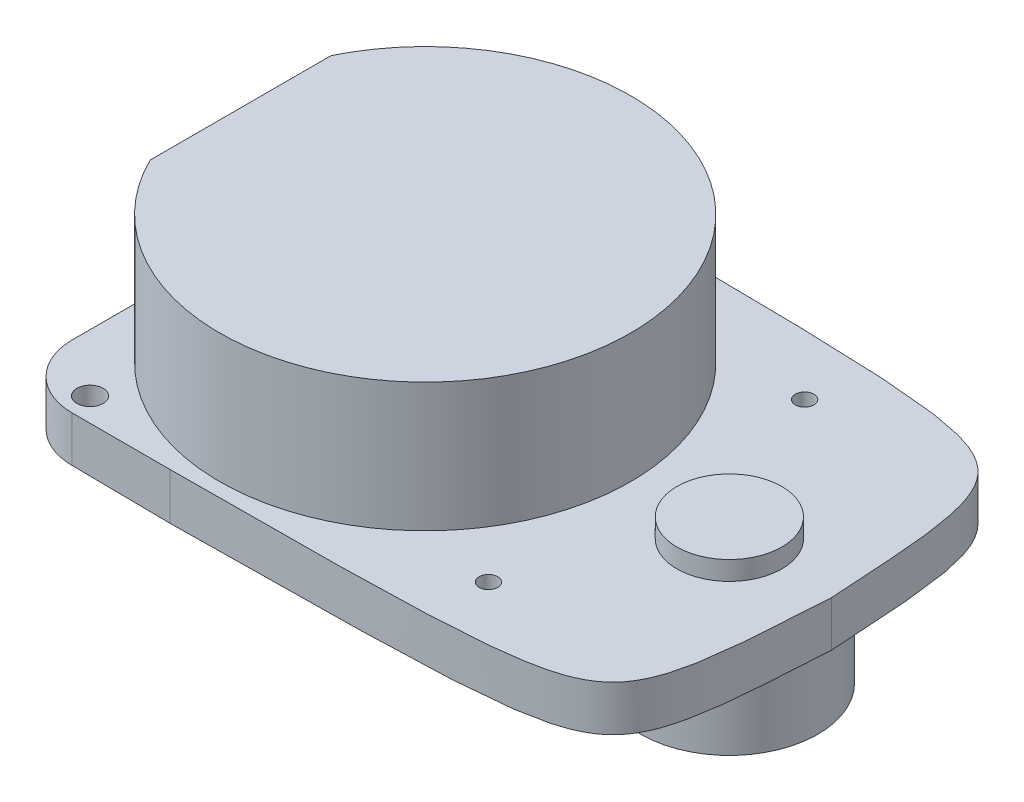
ISO-10303-21;
HEADER;
FILE_DESCRIPTION(('STEP AP214'),'2;1');
FILE_NAME('part.step','',(''),(''),'','','');
FILE_SCHEMA(('AUTOMOTIVE_DESIGN { 1 0 10303 214 1 1 1 1 }'));
ENDSEC;
DATA;
#1=APPLICATION_CONTEXT('core data for automotive mechanical design processes');
#2=APPLICATION_PROTOCOL_DEFINITION('international standard','automotive_design',2000,#1);
#3=PRODUCT_CONTEXT('',#1,'mechanical');
#4=PRODUCT('Part','Part','',(#3));
#5=PRODUCT_RELATED_PRODUCT_CATEGORY('part','',(#4));
#6=PRODUCT_DEFINITION_FORMATION('','',#4);
#7=PRODUCT_DEFINITION_CONTEXT('part definition',#1,'design');
#8=PRODUCT_DEFINITION('design','',#6,#7);
#9=PRODUCT_DEFINITION_SHAPE('','',#8);
#10=(LENGTH_UNIT() NAMED_UNIT(*) SI_UNIT(.MILLI.,.METRE.));
#11=(NAMED_UNIT(*) PLANE_ANGLE_UNIT() SI_UNIT($,.RADIAN.));
#12=(NAMED_UNIT(*) SI_UNIT($,.STERADIAN.) SOLID_ANGLE_UNIT());
#13=UNCERTAINTY_MEASURE_WITH_UNIT(LENGTH_MEASURE(1.E-05),#10,'distance_accuracy_value','');
#14=(GEOMETRIC_REPRESENTATION_CONTEXT(3) GLOBAL_UNCERTAINTY_ASSIGNED_CONTEXT((#13)) GLOBAL_UNIT_ASSIGNED_CONTEXT((#10,
#11,#12)) REPRESENTATION_CONTEXT('',''));
#15=CARTESIAN_POINT('',(0.,0.,0.));
#16=DIRECTION('',(0.,0.,1.));
#17=DIRECTION('',(1.,0.,0.));
#18=AXIS2_PLACEMENT_3D('',#15,#16,#17);
#19=CARTESIAN_POINT('',(-48.1,40.16,0.));
#20=DIRECTION('',(0.,-1.,0.));
#21=DIRECTION('',(0.,0.,-1.));
#22=AXIS2_PLACEMENT_3D('',#19,#20,#21);
#23=CYLINDRICAL_SURFACE('',#22,32.5);
#24=DIRECTION('',(0.,1.,0.));
#25=VECTOR('',#24,1.);
#26=CARTESIAN_POINT('',(-77.2815278238156,-9.00565904567411,-14.3069365647534));
#27=LINE('',#26,#25);
#28=CARTESIAN_POINT('',(-77.2815278238156,19.8,-14.3069365647534));
#29=VERTEX_POINT('',#28);
#30=CARTESIAN_POINT('',(-77.2815278238156,40.16,-14.3069365647534));
#31=VERTEX_POINT('',#30);
#32=EDGE_CURVE('E127',#29,#31,#27,.T.);
#33=ORIENTED_EDGE('',*,*,#32,.T.);
#34=CARTESIAN_POINT('',(-48.1,40.16,0.));
#35=DIRECTION('',(0.,1.,0.));
#36=DIRECTION('',(0.,0.,1.));
#37=AXIS2_PLACEMENT_3D('',#34,#35,#36);
#38=CIRCLE('',#37,32.5);
#39=CARTESIAN_POINT('',(-77.2815278238156,40.16,14.3069365647534));
#40=VERTEX_POINT('',#39);
#41=EDGE_CURVE('E137',#40,#31,#38,.T.);
#42=ORIENTED_EDGE('',*,*,#41,.F.);
#43=DIRECTION('',(0.,1.,0.));
#44=VECTOR('',#43,1.);
#45=CARTESIAN_POINT('',(-77.2815278238156,-9.00565904567411,14.3069365647534));
#46=LINE('',#45,#44);
#47=CARTESIAN_POINT('',(-77.2815278238156,19.8,14.3069365647534));
#48=VERTEX_POINT('',#47);
#49=EDGE_CURVE('E130',#48,#40,#46,.T.);
#50=ORIENTED_EDGE('',*,*,#49,.F.);
#51=CARTESIAN_POINT('',(-48.1,19.8,0.));
#52=DIRECTION('',(0.,1.,0.));
#53=DIRECTION('',(0.,0.,1.));
#54=AXIS2_PLACEMENT_3D('',#51,#52,#53);
#55=CIRCLE('',#54,32.5);
#56=EDGE_CURVE('E139',#48,#29,#55,.T.);
#57=ORIENTED_EDGE('',*,*,#56,.T.);
#58=EDGE_LOOP('',(#33,#42,#50,#57));
#59=FACE_BOUND('',#58,.T.);
#60=ADVANCED_FACE('F42',(#59),#23,.T.);
#61=CARTESIAN_POINT('',(-48.1,40.16,0.));
#62=DIRECTION('',(0.,1.,0.));
#63=DIRECTION('',(0.,0.,1.));
#64=AXIS2_PLACEMENT_3D('',#61,#62,#63);
#65=PLANE('',#64);
#66=ORIENTED_EDGE('',*,*,#41,.T.);
#67=DIRECTION('',(0.,0.,1.));
#68=VECTOR('',#67,1.);
#69=CARTESIAN_POINT('',(-77.2815278238156,40.16,0.));
#70=LINE('',#69,#68);
#71=EDGE_CURVE('E124',#31,#40,#70,.T.);
#72=ORIENTED_EDGE('',*,*,#71,.T.);
#73=EDGE_LOOP('',(#66,#72));
#74=FACE_BOUND('',#73,.T.);
#75=ADVANCED_FACE('F141',(#74),#65,.T.);
#76=CARTESIAN_POINT('',(0.,12.6,0.));
#77=DIRECTION('',(0.,-1.,0.));
#78=DIRECTION('',(0.,0.,-1.));
#79=AXIS2_PLACEMENT_3D('',#76,#77,#78);
#80=CYLINDRICAL_SURFACE('',#79,14.);
#81=CARTESIAN_POINT('',(0.,12.6,0.));
#82=DIRECTION('',(0.,1.,0.));
#83=DIRECTION('',(0.,0.,1.));
#84=AXIS2_PLACEMENT_3D('',#81,#82,#83);
#85=CIRCLE('',#84,14.);
#86=CARTESIAN_POINT('',(0.,12.6,14.));
#87=VERTEX_POINT('',#86);
#88=EDGE_CURVE('E153',#87,#87,#85,.T.);
#89=ORIENTED_EDGE('',*,*,#88,.F.);
#90=EDGE_LOOP('',(#89));
#91=FACE_BOUND('',#90,.T.);
#92=CARTESIAN_POINT('',(0.,0.,0.));
#93=DIRECTION('',(0.,1.,0.));
#94=DIRECTION('',(0.,0.,1.));
#95=AXIS2_PLACEMENT_3D('',#92,#93,#94);
#96=CIRCLE('',#95,14.);
#97=CARTESIAN_POINT('',(0.,0.,14.));
#98=VERTEX_POINT('',#97);
#99=EDGE_CURVE('E226',#98,#98,#96,.T.);
#100=ORIENTED_EDGE('',*,*,#99,.T.);
#101=EDGE_LOOP('',(#100));
#102=FACE_BOUND('',#101,.T.);
#103=ADVANCED_FACE('F371',(#91,#102),#80,.T.);
#104=CARTESIAN_POINT('',(0.,0.,0.));
#105=DIRECTION('',(0.,1.,0.));
#106=DIRECTION('',(0.,0.,1.));
#107=AXIS2_PLACEMENT_3D('',#104,#105,#106);
#108=PLANE('',#107);
#109=ORIENTED_EDGE('',*,*,#99,.F.);
#110=EDGE_LOOP('',(#109));
#111=FACE_BOUND('',#110,.T.);
#112=ADVANCED_FACE('F212',(#111),#108,.F.);
#113=CARTESIAN_POINT('',(0.,19.8,0.));
#114=DIRECTION('',(0.,-1.,0.));
#115=DIRECTION('',(0.,0.,-1.));
#116=AXIS2_PLACEMENT_3D('',#113,#114,#115);
#117=PLANE('',#116);
#118=CARTESIAN_POINT('',(0.,19.8,0.));
#119=DIRECTION('',(0.,-1.,0.));
#120=DIRECTION('',(0.,0.,-1.));
#121=AXIS2_PLACEMENT_3D('',#118,#119,#120);
#122=CIRCLE('',#121,8.295);
#123=CARTESIAN_POINT('',(0.,19.8,-8.295));
#124=VERTEX_POINT('',#123);
#125=EDGE_CURVE('E152',#124,#124,#122,.F.);
#126=ORIENTED_EDGE('',*,*,#125,.F.);
#127=EDGE_LOOP('',(#126));
#128=FACE_BOUND('',#127,.T.);
#129=DIRECTION('',(0.,0.,-1.));
#130=VECTOR('',#129,1.);
#131=CARTESIAN_POINT('',(-77.2815278238156,19.8,0.));
#132=LINE('',#131,#130);
#133=EDGE_CURVE('E143',#48,#29,#132,.T.);
#134=ORIENTED_EDGE('',*,*,#133,.T.);
#135=ORIENTED_EDGE('',*,*,#56,.F.);
#136=EDGE_LOOP('',(#134,#135));
#137=FACE_BOUND('',#136,.T.);
#138=DIRECTION('',(-1.,0.,0.));
#139=VECTOR('',#138,1.);
#140=CARTESIAN_POINT('',(16.33,19.8,-34.75));
#141=LINE('',#140,#139);
#142=CARTESIAN_POINT('',(-53.67,19.98,-34.75));
#143=VERTEX_POINT('',#142);
#144=CARTESIAN_POINT('',(-69.17,19.8,-34.75));
#145=VERTEX_POINT('',#144);
#146=EDGE_CURVE('E180',#143,#145,#141,.T.);
#147=ORIENTED_EDGE('',*,*,#146,.T.);
#148=CARTESIAN_POINT('',(-79.17,19.8,-24.75));
#149=CARTESIAN_POINT('',(-79.17,19.8,-34.75));
#150=CARTESIAN_POINT('',(-69.17,19.8,-34.75));
#151=(BOUNDED_CURVE() B_SPLINE_CURVE(2,(#148,#149,#150),.UNSPECIFIED.,.F.,
.F.) B_SPLINE_CURVE_WITH_KNOTS((3,3),(0.,1.),
.UNSPECIFIED.) CURVE() GEOMETRIC_REPRESENTATION_ITEM() RATIONAL_B_SPLINE_CURVE((1.,
0.707106781186547,1.)) REPRESENTATION_ITEM(''));
#152=CARTESIAN_POINT('',(-79.17,19.8,-24.75));
#153=VERTEX_POINT('',#152);
#154=EDGE_CURVE('E56',#145,#153,#151,.F.);
#155=ORIENTED_EDGE('',*,*,#154,.T.);
#156=DIRECTION('',(0.,0.,1.));
#157=VECTOR('',#156,1.);
#158=CARTESIAN_POINT('',(-79.17,19.8,-34.75));
#159=LINE('',#158,#157);
#160=CARTESIAN_POINT('',(-79.17,19.8,24.75));
#161=VERTEX_POINT('',#160);
#162=EDGE_CURVE('E183',#153,#161,#159,.T.);
#163=ORIENTED_EDGE('',*,*,#162,.T.);
#164=CARTESIAN_POINT('',(-69.17,19.8,34.75));
#165=CARTESIAN_POINT('',(-79.17,19.8,34.75));
#166=CARTESIAN_POINT('',(-79.17,19.8,24.75));
#167=(BOUNDED_CURVE() B_SPLINE_CURVE(2,(#164,#165,#166),.UNSPECIFIED.,.F.,
.F.) B_SPLINE_CURVE_WITH_KNOTS((3,3),(0.,1.),
.UNSPECIFIED.) CURVE() GEOMETRIC_REPRESENTATION_ITEM() RATIONAL_B_SPLINE_CURVE((1.,
0.707106781186547,1.)) REPRESENTATION_ITEM(''));
#168=CARTESIAN_POINT('',(-69.17,19.8,34.75));
#169=VERTEX_POINT('',#168);
#170=EDGE_CURVE('E63',#161,#169,#167,.F.);
#171=ORIENTED_EDGE('',*,*,#170,.T.);
#172=DIRECTION('',(1.,0.,0.));
#173=VECTOR('',#172,1.);
#174=CARTESIAN_POINT('',(16.33,19.8,34.75));
#175=LINE('',#174,#173);
#176=CARTESIAN_POINT('',(-53.67,19.8,34.75));
#177=VERTEX_POINT('',#176);
#178=EDGE_CURVE('E220',#169,#177,#175,.T.);
#179=ORIENTED_EDGE('',*,*,#178,.T.);
#180=CARTESIAN_POINT('',(16.33,19.8,-35.25));
#181=CARTESIAN_POINT('',(16.33,19.8,34.75));
#182=CARTESIAN_POINT('',(-53.67,19.8,34.75));
#183=(BOUNDED_CURVE() B_SPLINE_CURVE(2,(#180,#181,#182),.UNSPECIFIED.,.F.,
.F.) B_SPLINE_CURVE_WITH_KNOTS((3,3),(0.,1.),
.UNSPECIFIED.) CURVE() GEOMETRIC_REPRESENTATION_ITEM() RATIONAL_B_SPLINE_CURVE((1.,
4.94974746830583,1.)) REPRESENTATION_ITEM(''));
#184=CARTESIAN_POINT('',(16.151573798948,19.8,0.00118088121997797));
#185=VERTEX_POINT('',#184);
#186=EDGE_CURVE('E311',#177,#185,#183,.F.);
#187=ORIENTED_EDGE('',*,*,#186,.T.);
#188=CARTESIAN_POINT('',(-53.67,19.8,-34.75));
#189=CARTESIAN_POINT('',(16.33,19.8,-34.75));
#190=CARTESIAN_POINT('',(16.33,19.8,35.25));
#191=(BOUNDED_CURVE() B_SPLINE_CURVE(2,(#188,#189,#190),.UNSPECIFIED.,.F.,
.F.) B_SPLINE_CURVE_WITH_KNOTS((3,3),(0.,1.),
.UNSPECIFIED.) CURVE() GEOMETRIC_REPRESENTATION_ITEM() RATIONAL_B_SPLINE_CURVE((1.,
4.94974746830583,1.)) REPRESENTATION_ITEM(''));
#192=EDGE_CURVE('E323',#185,#143,#191,.F.);
#193=ORIENTED_EDGE('',*,*,#192,.T.);
#194=EDGE_LOOP('',(#147,#155,#163,#171,#179,#187,#193));
#195=FACE_BOUND('',#194,.T.);
#196=CARTESIAN_POINT('',(-70.1,19.8,-31.));
#197=DIRECTION('',(0.,1.,0.));
#198=DIRECTION('',(0.,0.,1.));
#199=AXIS2_PLACEMENT_3D('',#196,#197,#198);
#200=CIRCLE('',#199,2.08017821050177);
#201=CARTESIAN_POINT('',(-70.1,19.8,-28.9198217894982));
#202=VERTEX_POINT('',#201);
#203=EDGE_CURVE('E169',#202,#202,#200,.T.);
#204=ORIENTED_EDGE('',*,*,#203,.F.);
#205=EDGE_LOOP('',(#204));
#206=FACE_BOUND('',#205,.T.);
#207=CARTESIAN_POINT('',(-13.1,19.8,-25.));
#208=DIRECTION('',(0.,1.,0.));
#209=DIRECTION('',(0.,0.,1.));
#210=AXIS2_PLACEMENT_3D('',#207,#208,#209);
#211=CIRCLE('',#210,1.4709081187223);
#212=CARTESIAN_POINT('',(-13.1,19.8,-23.5290918812777));
#213=VERTEX_POINT('',#212);
#214=EDGE_CURVE('E163',#213,#213,#211,.T.);
#215=ORIENTED_EDGE('',*,*,#214,.F.);
#216=EDGE_LOOP('',(#215));
#217=FACE_BOUND('',#216,.T.);
#218=CARTESIAN_POINT('',(-13.1,19.8,25.));
#219=DIRECTION('',(0.,1.,0.));
#220=DIRECTION('',(0.,0.,-1.));
#221=AXIS2_PLACEMENT_3D('',#218,#219,#220);
#222=CIRCLE('',#221,1.4709081187223);
#223=CARTESIAN_POINT('',(-13.1,19.8,23.5290918812777));
#224=VERTEX_POINT('',#223);
#225=EDGE_CURVE('E157',#224,#224,#222,.T.);
#226=ORIENTED_EDGE('',*,*,#225,.F.);
#227=EDGE_LOOP('',(#226));
#228=FACE_BOUND('',#227,.T.);
#229=CARTESIAN_POINT('',(-70.1,19.8,31.));
#230=DIRECTION('',(0.,1.,0.));
#231=DIRECTION('',(0.,0.,-1.));
#232=AXIS2_PLACEMENT_3D('',#229,#230,#231);
#233=CIRCLE('',#232,2.08017821050177);
#234=CARTESIAN_POINT('',(-70.1,19.8,28.9198217894982));
#235=VERTEX_POINT('',#234);
#236=EDGE_CURVE('E146',#235,#235,#233,.T.);
#237=ORIENTED_EDGE('',*,*,#236,.F.);
#238=EDGE_LOOP('',(#237));
#239=FACE_BOUND('',#238,.T.);
#240=ADVANCED_FACE('F288',(#128,#137,#195,#206,#217,#228,#239),#117,.F.);
#241=CARTESIAN_POINT('',(0.,12.6,0.));
#242=DIRECTION('',(0.,-1.,0.));
#243=DIRECTION('',(0.,0.,-1.));
#244=AXIS2_PLACEMENT_3D('',#241,#242,#243);
#245=PLANE('',#244);
#246=ORIENTED_EDGE('',*,*,#88,.T.);
#247=EDGE_LOOP('',(#246));
#248=FACE_BOUND('',#247,.T.);
#249=CARTESIAN_POINT('',(-13.1,12.6,25.));
#250=DIRECTION('',(0.,1.,0.));
#251=DIRECTION('',(0.,0.,-1.));
#252=AXIS2_PLACEMENT_3D('',#249,#250,#251);
#253=CIRCLE('',#252,1.4709081187223);
#254=CARTESIAN_POINT('',(-13.1,12.6,23.5290918812777));
#255=VERTEX_POINT('',#254);
#256=EDGE_CURVE('E155',#255,#255,#253,.T.);
#257=ORIENTED_EDGE('',*,*,#256,.T.);
#258=EDGE_LOOP('',(#257));
#259=FACE_BOUND('',#258,.T.);
#260=CARTESIAN_POINT('',(-70.1,12.6,-31.));
#261=DIRECTION('',(0.,1.,0.));
#262=DIRECTION('',(0.,0.,1.));
#263=AXIS2_PLACEMENT_3D('',#260,#261,#262);
#264=CIRCLE('',#263,2.08017821050177);
#265=CARTESIAN_POINT('',(-70.1,12.6,-28.9198217894982));
#266=VERTEX_POINT('',#265);
#267=EDGE_CURVE('E166',#266,#266,#264,.T.);
#268=ORIENTED_EDGE('',*,*,#267,.T.);
#269=EDGE_LOOP('',(#268));
#270=FACE_BOUND('',#269,.T.);
#271=DIRECTION('',(0.,0.,1.));
#272=VECTOR('',#271,1.);
#273=CARTESIAN_POINT('',(-79.17,12.6,-34.75));
#274=LINE('',#273,#272);
#275=CARTESIAN_POINT('',(-79.17,12.6,-24.75));
#276=VERTEX_POINT('',#275);
#277=CARTESIAN_POINT('',(-79.17,12.6,24.75));
#278=VERTEX_POINT('',#277);
#279=EDGE_CURVE('E236',#276,#278,#274,.T.);
#280=ORIENTED_EDGE('',*,*,#279,.F.);
#281=CARTESIAN_POINT('',(-69.17,12.6,-34.75));
#282=CARTESIAN_POINT('',(-79.17,12.6,-34.75));
#283=CARTESIAN_POINT('',(-79.17,12.6,-24.75));
#284=(BOUNDED_CURVE() B_SPLINE_CURVE(2,(#281,#282,#283),.UNSPECIFIED.,.F.,
.F.) B_SPLINE_CURVE_WITH_KNOTS((3,3),(0.,1.),
.UNSPECIFIED.) CURVE() GEOMETRIC_REPRESENTATION_ITEM() RATIONAL_B_SPLINE_CURVE((1.,
0.707106781186547,1.)) REPRESENTATION_ITEM(''));
#285=CARTESIAN_POINT('',(-69.17,12.6,-34.75));
#286=VERTEX_POINT('',#285);
#287=EDGE_CURVE('E487',#276,#286,#284,.F.);
#288=ORIENTED_EDGE('',*,*,#287,.T.);
#289=DIRECTION('',(-1.,0.,0.));
#290=VECTOR('',#289,1.);
#291=CARTESIAN_POINT('',(16.33,12.6,-34.75));
#292=LINE('',#291,#290);
#293=CARTESIAN_POINT('',(-53.67,12.6,-34.75));
#294=VERTEX_POINT('',#293);
#295=EDGE_CURVE('E172',#294,#286,#292,.T.);
#296=ORIENTED_EDGE('',*,*,#295,.F.);
#297=CARTESIAN_POINT('',(16.33,12.6,35.25));
#298=CARTESIAN_POINT('',(16.33,12.6,-34.75));
#299=CARTESIAN_POINT('',(-53.67,12.6,-34.75));
#300=(BOUNDED_CURVE() B_SPLINE_CURVE(2,(#297,#298,#299),.UNSPECIFIED.,.F.,
.F.) B_SPLINE_CURVE_WITH_KNOTS((3,3),(0.,1.),
.UNSPECIFIED.) CURVE() GEOMETRIC_REPRESENTATION_ITEM() RATIONAL_B_SPLINE_CURVE((1.,
4.94974746830583,1.)) REPRESENTATION_ITEM(''));
#301=CARTESIAN_POINT('',(16.1511166169273,12.6,0.000558707250198828));
#302=VERTEX_POINT('',#301);
#303=EDGE_CURVE('E348',#294,#302,#300,.F.);
#304=ORIENTED_EDGE('',*,*,#303,.T.);
#305=CARTESIAN_POINT('',(-53.67,12.6,34.75));
#306=CARTESIAN_POINT('',(16.33,12.6,34.75));
#307=CARTESIAN_POINT('',(16.33,12.6,-35.25));
#308=(BOUNDED_CURVE() B_SPLINE_CURVE(2,(#305,#306,#307),.UNSPECIFIED.,.F.,
.F.) B_SPLINE_CURVE_WITH_KNOTS((3,3),(0.,1.),
.UNSPECIFIED.) CURVE() GEOMETRIC_REPRESENTATION_ITEM() RATIONAL_B_SPLINE_CURVE((1.,
4.94974746830583,1.)) REPRESENTATION_ITEM(''));
#309=CARTESIAN_POINT('',(-53.67,12.42,34.75));
#310=VERTEX_POINT('',#309);
#311=EDGE_CURVE('E433',#302,#310,#308,.F.);
#312=ORIENTED_EDGE('',*,*,#311,.T.);
#313=DIRECTION('',(1.,0.,0.));
#314=VECTOR('',#313,1.);
#315=CARTESIAN_POINT('',(16.33,12.6,34.75));
#316=LINE('',#315,#314);
#317=CARTESIAN_POINT('',(-69.17,12.6,34.75));
#318=VERTEX_POINT('',#317);
#319=EDGE_CURVE('E184',#318,#310,#316,.T.);
#320=ORIENTED_EDGE('',*,*,#319,.F.);
#321=CARTESIAN_POINT('',(-79.17,12.6,24.75));
#322=CARTESIAN_POINT('',(-79.17,12.6,34.75));
#323=CARTESIAN_POINT('',(-69.17,12.6,34.75));
#324=(BOUNDED_CURVE() B_SPLINE_CURVE(2,(#321,#322,#323),.UNSPECIFIED.,.F.,
.F.) B_SPLINE_CURVE_WITH_KNOTS((3,3),(0.,1.),
.UNSPECIFIED.) CURVE() GEOMETRIC_REPRESENTATION_ITEM() RATIONAL_B_SPLINE_CURVE((1.,
0.707106781186547,1.)) REPRESENTATION_ITEM(''));
#325=EDGE_CURVE('E275',#318,#278,#324,.F.);
#326=ORIENTED_EDGE('',*,*,#325,.T.);
#327=EDGE_LOOP('',(#280,#288,#296,#304,#312,#320,#326));
#328=FACE_BOUND('',#327,.T.);
#329=CARTESIAN_POINT('',(-13.1,12.6,-25.));
#330=DIRECTION('',(0.,1.,0.));
#331=DIRECTION('',(0.,0.,1.));
#332=AXIS2_PLACEMENT_3D('',#329,#330,#331);
#333=CIRCLE('',#332,1.4709081187223);
#334=CARTESIAN_POINT('',(-13.1,12.6,-23.5290918812777));
#335=VERTEX_POINT('',#334);
#336=EDGE_CURVE('E160',#335,#335,#333,.T.);
#337=ORIENTED_EDGE('',*,*,#336,.T.);
#338=EDGE_LOOP('',(#337));
#339=FACE_BOUND('',#338,.T.);
#340=CARTESIAN_POINT('',(-70.1,12.6,31.));
#341=DIRECTION('',(0.,1.,0.));
#342=DIRECTION('',(0.,0.,-1.));
#343=AXIS2_PLACEMENT_3D('',#340,#341,#342);
#344=CIRCLE('',#343,2.08017821050177);
#345=CARTESIAN_POINT('',(-70.1,12.6,28.9198217894982));
#346=VERTEX_POINT('',#345);
#347=EDGE_CURVE('E142',#346,#346,#344,.T.);
#348=ORIENTED_EDGE('',*,*,#347,.T.);
#349=EDGE_LOOP('',(#348));
#350=FACE_BOUND('',#349,.T.);
#351=ADVANCED_FACE('F209',(#248,#259,#270,#328,#339,#350),#245,.T.);
#352=CARTESIAN_POINT('',(16.33,19.8,-34.75));
#353=DIRECTION('',(0.,0.,1.));
#354=DIRECTION('',(1.,0.,0.));
#355=AXIS2_PLACEMENT_3D('',#352,#353,#354);
#356=PLANE('',#355);
#357=ORIENTED_EDGE('',*,*,#295,.T.);
#358=CARTESIAN_POINT('',(-69.17,20.16,-34.75));
#359=CARTESIAN_POINT('',(-69.17,17.52,-34.75));
#360=CARTESIAN_POINT('',(-69.17,14.88,-34.75));
#361=CARTESIAN_POINT('',(-69.17,12.24,-34.75));
#362=(BOUNDED_CURVE() B_SPLINE_CURVE(3,(#358,#359,#360,#361),.UNSPECIFIED.,.F.,
.F.) B_SPLINE_CURVE_WITH_KNOTS((4,4),(-0.00036,0.00756),
.UNSPECIFIED.) CURVE() GEOMETRIC_REPRESENTATION_ITEM() RATIONAL_B_SPLINE_CURVE((1.,1.,1.,1.)) REPRESENTATION_ITEM(''));
#363=EDGE_CURVE('E72',#286,#145,#362,.F.);
#364=ORIENTED_EDGE('',*,*,#363,.T.);
#365=ORIENTED_EDGE('',*,*,#146,.F.);
#366=CARTESIAN_POINT('',(-53.67,12.24,-34.75));
#367=CARTESIAN_POINT('',(-53.67,14.88,-34.75));
#368=CARTESIAN_POINT('',(-53.67,17.52,-34.75));
#369=CARTESIAN_POINT('',(-53.67,20.16,-34.75));
#370=(BOUNDED_CURVE() B_SPLINE_CURVE(3,(#366,#367,#368,#369),.UNSPECIFIED.,.F.,
.F.) B_SPLINE_CURVE_WITH_KNOTS((4,4),(-0.00036,0.00756),
.UNSPECIFIED.) CURVE() GEOMETRIC_REPRESENTATION_ITEM() RATIONAL_B_SPLINE_CURVE((1.,1.,1.,1.)) REPRESENTATION_ITEM(''));
#371=EDGE_CURVE('E190',#143,#294,#370,.F.);
#372=ORIENTED_EDGE('',*,*,#371,.T.);
#373=EDGE_LOOP('',(#357,#364,#365,#372));
#374=FACE_BOUND('',#373,.T.);
#375=ADVANCED_FACE('F198',(#374),#356,.F.);
#376=CARTESIAN_POINT('',(-79.17,19.8,-34.75));
#377=DIRECTION('',(1.,0.,0.));
#378=DIRECTION('',(0.,0.,-1.));
#379=AXIS2_PLACEMENT_3D('',#376,#377,#378);
#380=PLANE('',#379);
#381=ORIENTED_EDGE('',*,*,#162,.F.);
#382=CARTESIAN_POINT('',(-79.17,12.24,-24.75));
#383=CARTESIAN_POINT('',(-79.17,14.88,-24.75));
#384=CARTESIAN_POINT('',(-79.17,17.52,-24.75));
#385=CARTESIAN_POINT('',(-79.17,20.16,-24.75));
#386=(BOUNDED_CURVE() B_SPLINE_CURVE(3,(#382,#383,#384,#385),.UNSPECIFIED.,.F.,
.F.) B_SPLINE_CURVE_WITH_KNOTS((4,4),(-0.00036,0.00756),
.UNSPECIFIED.) CURVE() GEOMETRIC_REPRESENTATION_ITEM() RATIONAL_B_SPLINE_CURVE((1.,1.,1.,1.)) REPRESENTATION_ITEM(''));
#387=EDGE_CURVE('E261',#153,#276,#386,.F.);
#388=ORIENTED_EDGE('',*,*,#387,.T.);
#389=ORIENTED_EDGE('',*,*,#279,.T.);
#390=CARTESIAN_POINT('',(-79.17,20.16,24.75));
#391=CARTESIAN_POINT('',(-79.17,17.52,24.75));
#392=CARTESIAN_POINT('',(-79.17,14.88,24.75));
#393=CARTESIAN_POINT('',(-79.17,12.24,24.75));
#394=(BOUNDED_CURVE() B_SPLINE_CURVE(3,(#390,#391,#392,#393),.UNSPECIFIED.,.F.,
.F.) B_SPLINE_CURVE_WITH_KNOTS((4,4),(-0.00036,0.00756),
.UNSPECIFIED.) CURVE() GEOMETRIC_REPRESENTATION_ITEM() RATIONAL_B_SPLINE_CURVE((1.,1.,1.,1.)) REPRESENTATION_ITEM(''));
#395=EDGE_CURVE('E249',#278,#161,#394,.F.);
#396=ORIENTED_EDGE('',*,*,#395,.T.);
#397=EDGE_LOOP('',(#381,#388,#389,#396));
#398=FACE_BOUND('',#397,.T.);
#399=ADVANCED_FACE('F208',(#398),#380,.F.);
#400=CARTESIAN_POINT('',(16.33,19.8,34.75));
#401=DIRECTION('',(0.,0.,-1.));
#402=DIRECTION('',(-1.,0.,0.));
#403=AXIS2_PLACEMENT_3D('',#400,#401,#402);
#404=PLANE('',#403);
#405=ORIENTED_EDGE('',*,*,#178,.F.);
#406=CARTESIAN_POINT('',(-69.17,12.24,34.75));
#407=CARTESIAN_POINT('',(-69.17,14.88,34.75));
#408=CARTESIAN_POINT('',(-69.17,17.52,34.75));
#409=CARTESIAN_POINT('',(-69.17,20.16,34.75));
#410=(BOUNDED_CURVE() B_SPLINE_CURVE(3,(#406,#407,#408,#409),.UNSPECIFIED.,.F.,
.F.) B_SPLINE_CURVE_WITH_KNOTS((4,4),(-0.00036,0.00756),
.UNSPECIFIED.) CURVE() GEOMETRIC_REPRESENTATION_ITEM() RATIONAL_B_SPLINE_CURVE((1.,1.,1.,1.)) REPRESENTATION_ITEM(''));
#411=EDGE_CURVE('E12',#169,#318,#410,.F.);
#412=ORIENTED_EDGE('',*,*,#411,.T.);
#413=ORIENTED_EDGE('',*,*,#319,.T.);
#414=CARTESIAN_POINT('',(-53.67,20.16,34.75));
#415=CARTESIAN_POINT('',(-53.67,17.52,34.75));
#416=CARTESIAN_POINT('',(-53.67,14.88,34.75));
#417=CARTESIAN_POINT('',(-53.67,12.24,34.75));
#418=(BOUNDED_CURVE() B_SPLINE_CURVE(3,(#414,#415,#416,#417),.UNSPECIFIED.,.F.,
.F.) B_SPLINE_CURVE_WITH_KNOTS((4,4),(-0.00036,0.00756),
.UNSPECIFIED.) CURVE() GEOMETRIC_REPRESENTATION_ITEM() RATIONAL_B_SPLINE_CURVE((1.,1.,1.,1.)) REPRESENTATION_ITEM(''));
#419=EDGE_CURVE('E336',#310,#177,#418,.F.);
#420=ORIENTED_EDGE('',*,*,#419,.T.);
#421=EDGE_LOOP('',(#405,#412,#413,#420));
#422=FACE_BOUND('',#421,.T.);
#423=ADVANCED_FACE('F292',(#422),#404,.F.);
#424=CARTESIAN_POINT('',(-70.1,19.8,-31.));
#425=DIRECTION('',(0.,-1.,0.));
#426=DIRECTION('',(0.,0.,-1.));
#427=AXIS2_PLACEMENT_3D('',#424,#425,#426);
#428=CYLINDRICAL_SURFACE('',#427,2.08017821050177);
#429=ORIENTED_EDGE('',*,*,#203,.T.);
#430=EDGE_LOOP('',(#429));
#431=FACE_BOUND('',#430,.T.);
#432=ORIENTED_EDGE('',*,*,#267,.F.);
#433=EDGE_LOOP('',(#432));
#434=FACE_BOUND('',#433,.T.);
#435=ADVANCED_FACE('F471',(#431,#434),#428,.F.);
#436=CARTESIAN_POINT('',(-13.1,19.8,-25.));
#437=DIRECTION('',(0.,-1.,0.));
#438=DIRECTION('',(0.,0.,-1.));
#439=AXIS2_PLACEMENT_3D('',#436,#437,#438);
#440=CYLINDRICAL_SURFACE('',#439,1.4709081187223);
#441=ORIENTED_EDGE('',*,*,#214,.T.);
#442=EDGE_LOOP('',(#441));
#443=FACE_BOUND('',#442,.T.);
#444=ORIENTED_EDGE('',*,*,#336,.F.);
#445=EDGE_LOOP('',(#444));
#446=FACE_BOUND('',#445,.T.);
#447=ADVANCED_FACE('F468',(#443,#446),#440,.F.);
#448=CARTESIAN_POINT('',(-13.1,19.8,25.));
#449=DIRECTION('',(0.,-1.,0.));
#450=DIRECTION('',(0.,0.,-1.));
#451=AXIS2_PLACEMENT_3D('',#448,#449,#450);
#452=CYLINDRICAL_SURFACE('',#451,1.4709081187223);
#453=ORIENTED_EDGE('',*,*,#225,.T.);
#454=EDGE_LOOP('',(#453));
#455=FACE_BOUND('',#454,.T.);
#456=ORIENTED_EDGE('',*,*,#256,.F.);
#457=EDGE_LOOP('',(#456));
#458=FACE_BOUND('',#457,.T.);
#459=ADVANCED_FACE('F464',(#455,#458),#452,.F.);
#460=CARTESIAN_POINT('',(-70.1,19.8,31.));
#461=DIRECTION('',(0.,-1.,0.));
#462=DIRECTION('',(0.,0.,-1.));
#463=AXIS2_PLACEMENT_3D('',#460,#461,#462);
#464=CYLINDRICAL_SURFACE('',#463,2.08017821050177);
#465=ORIENTED_EDGE('',*,*,#236,.T.);
#466=EDGE_LOOP('',(#465));
#467=FACE_BOUND('',#466,.T.);
#468=ORIENTED_EDGE('',*,*,#347,.F.);
#469=EDGE_LOOP('',(#468));
#470=FACE_BOUND('',#469,.T.);
#471=ADVANCED_FACE('F462',(#467,#470),#464,.F.);
#472=CARTESIAN_POINT('',(-77.2815278238156,-9.00565904567411,0.));
#473=DIRECTION('',(-1.,0.,0.));
#474=DIRECTION('',(0.,0.,1.));
#475=AXIS2_PLACEMENT_3D('',#472,#473,#474);
#476=PLANE('',#475);
#477=ORIENTED_EDGE('',*,*,#49,.T.);
#478=ORIENTED_EDGE('',*,*,#71,.F.);
#479=ORIENTED_EDGE('',*,*,#32,.F.);
#480=ORIENTED_EDGE('',*,*,#133,.F.);
#481=EDGE_LOOP('',(#477,#478,#479,#480));
#482=FACE_BOUND('',#481,.T.);
#483=ADVANCED_FACE('F126',(#482),#476,.T.);
#484=CARTESIAN_POINT('',(0.,22.8,0.));
#485=DIRECTION('',(0.,-1.,0.));
#486=DIRECTION('',(0.,0.,-1.));
#487=AXIS2_PLACEMENT_3D('',#484,#485,#486);
#488=CYLINDRICAL_SURFACE('',#487,8.295);
#489=CARTESIAN_POINT('',(0.,22.8,0.));
#490=DIRECTION('',(0.,1.,0.));
#491=DIRECTION('',(0.,0.,1.));
#492=AXIS2_PLACEMENT_3D('',#489,#490,#491);
#493=CIRCLE('',#492,8.295);
#494=CARTESIAN_POINT('',(0.,22.8,8.295));
#495=VERTEX_POINT('',#494);
#496=EDGE_CURVE('E134',#495,#495,#493,.T.);
#497=ORIENTED_EDGE('',*,*,#496,.F.);
#498=EDGE_LOOP('',(#497));
#499=FACE_BOUND('',#498,.T.);
#500=ORIENTED_EDGE('',*,*,#125,.T.);
#501=EDGE_LOOP('',(#500));
#502=FACE_BOUND('',#501,.T.);
#503=ADVANCED_FACE('F627',(#499,#502),#488,.T.);
#504=CARTESIAN_POINT('',(0.,22.8,0.));
#505=DIRECTION('',(0.,1.,0.));
#506=DIRECTION('',(0.,0.,1.));
#507=AXIS2_PLACEMENT_3D('',#504,#505,#506);
#508=PLANE('',#507);
#509=ORIENTED_EDGE('',*,*,#496,.T.);
#510=EDGE_LOOP('',(#509));
#511=FACE_BOUND('',#510,.T.);
#512=ADVANCED_FACE('F621',(#511),#508,.T.);
#513=CARTESIAN_POINT('',(16.33,20.16,-35.25));
#514=CARTESIAN_POINT('',(16.33,17.52,-35.25));
#515=CARTESIAN_POINT('',(16.33,14.88,-35.25));
#516=CARTESIAN_POINT('',(16.33,12.24,-35.25));
#517=CARTESIAN_POINT('',(16.33,20.16,34.75));
#518=CARTESIAN_POINT('',(16.33,17.52,34.75));
#519=CARTESIAN_POINT('',(16.33,14.88,34.75));
#520=CARTESIAN_POINT('',(16.33,12.24,34.75));
#521=CARTESIAN_POINT('',(-53.67,20.16,34.75));
#522=CARTESIAN_POINT('',(-53.67,17.52,34.75));
#523=CARTESIAN_POINT('',(-53.67,14.88,34.75));
#524=CARTESIAN_POINT('',(-53.67,12.24,34.75));
#525=(BOUNDED_SURFACE() B_SPLINE_SURFACE(2,3,((#513,#514,#515,#516),(#517,#518,#519,#520),(#521,
#522,#523,#524)),.UNSPECIFIED.,.F.,.F.,.F.) B_SPLINE_SURFACE_WITH_KNOTS((3,3),(4,4),(0.,1.),
(-0.00036,0.00756),
.UNSPECIFIED.) GEOMETRIC_REPRESENTATION_ITEM() RATIONAL_B_SPLINE_SURFACE(((1.,1.,1.,1.),
(4.94974746830583,4.94974746830583,4.94974746830583,4.94974746830583),(1.,1.,1.,1.))) REPRESENTATION_ITEM('') SURFACE());
#526=CARTESIAN_POINT('',(15.972494156954,20.16,-1.19098217850313E-13));
#527=CARTESIAN_POINT('',(15.972494156954,17.52,-1.19098217850313E-13));
#528=CARTESIAN_POINT('',(15.972494156954,14.88,-1.19098217850313E-13));
#529=CARTESIAN_POINT('',(15.972494156954,12.24,-1.19098217850313E-13));
#530=(BOUNDED_CURVE() B_SPLINE_CURVE(3,(#526,#527,#528,#529),.UNSPECIFIED.,.F.,
.F.) B_SPLINE_CURVE_WITH_KNOTS((4,4),(-0.00036,0.00756),
.UNSPECIFIED.) CURVE() GEOMETRIC_REPRESENTATION_ITEM() RATIONAL_B_SPLINE_CURVE((1.66046545305913,
1.66046545305913,1.66046545305913,1.66046545305913)) REPRESENTATION_ITEM(''));
#531=EDGE_CURVE('E396',#185,#302,#530,.T.);
#532=ORIENTED_EDGE('',*,*,#531,.F.);
#533=ORIENTED_EDGE('',*,*,#186,.F.);
#534=ORIENTED_EDGE('',*,*,#419,.F.);
#535=ORIENTED_EDGE('',*,*,#311,.F.);
#536=EDGE_LOOP('',(#532,#533,#534,#535));
#537=FACE_BOUND('',#536,.T.);
#538=ADVANCED_FACE('F370',(#537),#525,.T.);
#539=CARTESIAN_POINT('',(-53.67,20.16,-34.75));
#540=CARTESIAN_POINT('',(-53.67,17.52,-34.75));
#541=CARTESIAN_POINT('',(-53.67,14.88,-34.75));
#542=CARTESIAN_POINT('',(-53.67,12.24,-34.75));
#543=CARTESIAN_POINT('',(16.33,20.16,-34.75));
#544=CARTESIAN_POINT('',(16.33,17.52,-34.75));
#545=CARTESIAN_POINT('',(16.33,14.88,-34.75));
#546=CARTESIAN_POINT('',(16.33,12.24,-34.75));
#547=CARTESIAN_POINT('',(16.33,20.16,35.25));
#548=CARTESIAN_POINT('',(16.33,17.52,35.25));
#549=CARTESIAN_POINT('',(16.33,14.88,35.25));
#550=CARTESIAN_POINT('',(16.33,12.24,35.25));
#551=(BOUNDED_SURFACE() B_SPLINE_SURFACE(2,3,((#539,#540,#541,#542),(#543,#544,#545,#546),(#547,
#548,#549,#550)),.UNSPECIFIED.,.F.,.F.,.F.) B_SPLINE_SURFACE_WITH_KNOTS((3,3),(4,4),(0.,1.),
(-0.00036,0.00756),
.UNSPECIFIED.) GEOMETRIC_REPRESENTATION_ITEM() RATIONAL_B_SPLINE_SURFACE(((1.,1.,1.,1.),
(4.94974746830583,4.94974746830583,4.94974746830583,4.94974746830583),(1.,1.,1.,1.))) REPRESENTATION_ITEM('') SURFACE());
#552=ORIENTED_EDGE('',*,*,#192,.F.);
#553=ORIENTED_EDGE('',*,*,#531,.T.);
#554=ORIENTED_EDGE('',*,*,#303,.F.);
#555=ORIENTED_EDGE('',*,*,#371,.F.);
#556=EDGE_LOOP('',(#552,#553,#554,#555));
#557=FACE_BOUND('',#556,.T.);
#558=ADVANCED_FACE('F355',(#557),#551,.T.);
#559=CARTESIAN_POINT('',(-79.17,20.16,-24.75));
#560=CARTESIAN_POINT('',(-79.17,17.52,-24.75));
#561=CARTESIAN_POINT('',(-79.17,14.88,-24.75));
#562=CARTESIAN_POINT('',(-79.17,12.24,-24.75));
#563=CARTESIAN_POINT('',(-79.17,20.16,-34.75));
#564=CARTESIAN_POINT('',(-79.17,17.52,-34.75));
#565=CARTESIAN_POINT('',(-79.17,14.88,-34.75));
#566=CARTESIAN_POINT('',(-79.17,12.24,-34.75));
#567=CARTESIAN_POINT('',(-69.17,20.16,-34.75));
#568=CARTESIAN_POINT('',(-69.17,17.52,-34.75));
#569=CARTESIAN_POINT('',(-69.17,14.88,-34.75));
#570=CARTESIAN_POINT('',(-69.17,12.24,-34.75));
#571=(BOUNDED_SURFACE() B_SPLINE_SURFACE(2,3,((#559,#560,#561,#562),(#563,#564,#565,#566),(#567,
#568,#569,#570)),.UNSPECIFIED.,.F.,.F.,.F.) B_SPLINE_SURFACE_WITH_KNOTS((3,3),(4,4),(0.,1.),
(-0.00036,0.00756),
.UNSPECIFIED.) GEOMETRIC_REPRESENTATION_ITEM() RATIONAL_B_SPLINE_SURFACE(((1.,1.,1.,1.),
(0.707106781186547,0.707106781186547,0.707106781186547,0.707106781186547),(1.,1.,1.,1.))) REPRESENTATION_ITEM('') SURFACE());
#572=ORIENTED_EDGE('',*,*,#154,.F.);
#573=ORIENTED_EDGE('',*,*,#363,.F.);
#574=ORIENTED_EDGE('',*,*,#287,.F.);
#575=ORIENTED_EDGE('',*,*,#387,.F.);
#576=EDGE_LOOP('',(#572,#573,#574,#575));
#577=FACE_BOUND('',#576,.T.);
#578=ADVANCED_FACE('F369',(#577),#571,.T.);
#579=CARTESIAN_POINT('',(-69.17,20.16,34.75));
#580=CARTESIAN_POINT('',(-69.17,17.52,34.75));
#581=CARTESIAN_POINT('',(-69.17,14.88,34.75));
#582=CARTESIAN_POINT('',(-69.17,12.24,34.75));
#583=CARTESIAN_POINT('',(-79.17,20.16,34.75));
#584=CARTESIAN_POINT('',(-79.17,17.52,34.75));
#585=CARTESIAN_POINT('',(-79.17,14.88,34.75));
#586=CARTESIAN_POINT('',(-79.17,12.24,34.75));
#587=CARTESIAN_POINT('',(-79.17,20.16,24.75));
#588=CARTESIAN_POINT('',(-79.17,17.52,24.75));
#589=CARTESIAN_POINT('',(-79.17,14.88,24.75));
#590=CARTESIAN_POINT('',(-79.17,12.24,24.75));
#591=(BOUNDED_SURFACE() B_SPLINE_SURFACE(2,3,((#579,#580,#581,#582),(#583,#584,#585,#586),(#587,
#588,#589,#590)),.UNSPECIFIED.,.F.,.F.,.F.) B_SPLINE_SURFACE_WITH_KNOTS((3,3),(4,4),(0.,1.),
(-0.00036,0.00756),
.UNSPECIFIED.) GEOMETRIC_REPRESENTATION_ITEM() RATIONAL_B_SPLINE_SURFACE(((1.,1.,1.,1.),
(0.707106781186547,0.707106781186547,0.707106781186547,0.707106781186547),(1.,1.,1.,1.))) REPRESENTATION_ITEM('') SURFACE());
#592=ORIENTED_EDGE('',*,*,#170,.F.);
#593=ORIENTED_EDGE('',*,*,#395,.F.);
#594=ORIENTED_EDGE('',*,*,#325,.F.);
#595=ORIENTED_EDGE('',*,*,#411,.F.);
#596=EDGE_LOOP('',(#592,#593,#594,#595));
#597=FACE_BOUND('',#596,.T.);
#598=ADVANCED_FACE('F45',(#597),#591,.T.);
#599=CLOSED_SHELL('',(#60,#75,#103,#112,#240,#351,#375,#399,#423,#435,#447,#459,#471,#483,#503,
#512,#538,#558,#578,#598));
#600=MANIFOLD_SOLID_BREP('B2',#599);
#601=ADVANCED_BREP_SHAPE_REPRESENTATION('',(#18,#600),#14);
#602=SHAPE_DEFINITION_REPRESENTATION(#9,#601);
ENDSEC;
END-ISO-10303-21;
